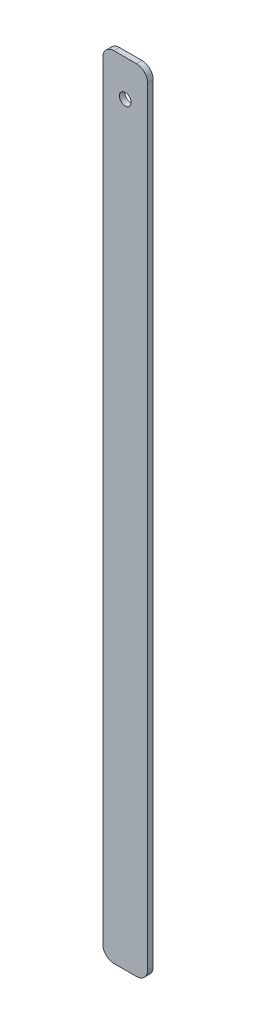
ISO-10303-21;
HEADER;
FILE_DESCRIPTION(('STEP AP214'),'2;1');
FILE_NAME('part.step','',(''),(''),'','','');
FILE_SCHEMA(('AUTOMOTIVE_DESIGN { 1 0 10303 214 1 1 1 1 }'));
ENDSEC;
DATA;
#1=APPLICATION_CONTEXT('core data for automotive mechanical design processes');
#2=APPLICATION_PROTOCOL_DEFINITION('international standard','automotive_design',2000,#1);
#3=PRODUCT_CONTEXT('',#1,'mechanical');
#4=PRODUCT('Part','Part','',(#3));
#5=PRODUCT_RELATED_PRODUCT_CATEGORY('part','',(#4));
#6=PRODUCT_DEFINITION_FORMATION('','',#4);
#7=PRODUCT_DEFINITION_CONTEXT('part definition',#1,'design');
#8=PRODUCT_DEFINITION('design','',#6,#7);
#9=PRODUCT_DEFINITION_SHAPE('','',#8);
#10=(LENGTH_UNIT() NAMED_UNIT(*) SI_UNIT(.MILLI.,.METRE.));
#11=(NAMED_UNIT(*) PLANE_ANGLE_UNIT() SI_UNIT($,.RADIAN.));
#12=(NAMED_UNIT(*) SI_UNIT($,.STERADIAN.) SOLID_ANGLE_UNIT());
#13=UNCERTAINTY_MEASURE_WITH_UNIT(LENGTH_MEASURE(1.E-05),#10,'distance_accuracy_value','');
#14=(GEOMETRIC_REPRESENTATION_CONTEXT(3) GLOBAL_UNCERTAINTY_ASSIGNED_CONTEXT((#13)) GLOBAL_UNIT_ASSIGNED_CONTEXT((#10,
#11,#12)) REPRESENTATION_CONTEXT('',''));
#15=CARTESIAN_POINT('',(0.,0.,0.));
#16=DIRECTION('',(0.,0.,1.));
#17=DIRECTION('',(1.,0.,0.));
#18=AXIS2_PLACEMENT_3D('',#15,#16,#17);
#19=CARTESIAN_POINT('',(0.,0.,1.));
#20=DIRECTION('',(0.,0.,-1.));
#21=DIRECTION('',(-1.,0.,0.));
#22=AXIS2_PLACEMENT_3D('',#19,#20,#21);
#23=PLANE('',#22);
#24=DIRECTION('',(-1.,0.,0.));
#25=VECTOR('',#24,1.);
#26=CARTESIAN_POINT('',(0.,141.2,1.));
#27=LINE('',#26,#25);
#28=CARTESIAN_POINT('',(6.,141.2,1.));
#29=VERTEX_POINT('',#28);
#30=CARTESIAN_POINT('',(2.,141.2,1.));
#31=VERTEX_POINT('',#30);
#32=EDGE_CURVE('E141',#29,#31,#27,.T.);
#33=ORIENTED_EDGE('',*,*,#32,.T.);
#34=CARTESIAN_POINT('',(2.,139.2,1.));
#35=DIRECTION('',(0.,0.,-1.));
#36=DIRECTION('',(-1.,0.,0.));
#37=AXIS2_PLACEMENT_3D('',#34,#35,#36);
#38=CIRCLE('',#37,2.);
#39=CARTESIAN_POINT('',(0.,139.2,1.));
#40=VERTEX_POINT('',#39);
#41=EDGE_CURVE('E160',#31,#40,#38,.F.);
#42=ORIENTED_EDGE('',*,*,#41,.T.);
#43=DIRECTION('',(0.,-1.,0.));
#44=VECTOR('',#43,1.);
#45=CARTESIAN_POINT('',(0.,0.,1.));
#46=LINE('',#45,#44);
#47=CARTESIAN_POINT('',(0.,2.,1.));
#48=VERTEX_POINT('',#47);
#49=EDGE_CURVE('E124',#40,#48,#46,.T.);
#50=ORIENTED_EDGE('',*,*,#49,.T.);
#51=CARTESIAN_POINT('',(2.,2.,1.));
#52=DIRECTION('',(0.,0.,-1.));
#53=DIRECTION('',(-1.,0.,0.));
#54=AXIS2_PLACEMENT_3D('',#51,#52,#53);
#55=CIRCLE('',#54,2.);
#56=CARTESIAN_POINT('',(2.,0.,1.));
#57=VERTEX_POINT('',#56);
#58=EDGE_CURVE('E155',#48,#57,#55,.F.);
#59=ORIENTED_EDGE('',*,*,#58,.T.);
#60=DIRECTION('',(1.,0.,0.));
#61=VECTOR('',#60,1.);
#62=CARTESIAN_POINT('',(0.,0.,1.));
#63=LINE('',#62,#61);
#64=CARTESIAN_POINT('',(6.,0.,1.));
#65=VERTEX_POINT('',#64);
#66=EDGE_CURVE('E171',#57,#65,#63,.T.);
#67=ORIENTED_EDGE('',*,*,#66,.T.);
#68=CARTESIAN_POINT('',(6.,2.,1.));
#69=DIRECTION('',(0.,0.,-1.));
#70=DIRECTION('',(-1.,0.,0.));
#71=AXIS2_PLACEMENT_3D('',#68,#69,#70);
#72=CIRCLE('',#71,2.);
#73=CARTESIAN_POINT('',(8.,2.,1.));
#74=VERTEX_POINT('',#73);
#75=EDGE_CURVE('E60',#65,#74,#72,.F.);
#76=ORIENTED_EDGE('',*,*,#75,.T.);
#77=DIRECTION('',(0.,1.,0.));
#78=VECTOR('',#77,1.);
#79=CARTESIAN_POINT('',(8.,0.,1.));
#80=LINE('',#79,#78);
#81=CARTESIAN_POINT('',(8.,139.2,1.));
#82=VERTEX_POINT('',#81);
#83=EDGE_CURVE('E179',#74,#82,#80,.T.);
#84=ORIENTED_EDGE('',*,*,#83,.T.);
#85=CARTESIAN_POINT('',(6.,139.2,1.));
#86=DIRECTION('',(0.,0.,-1.));
#87=DIRECTION('',(-1.,0.,0.));
#88=AXIS2_PLACEMENT_3D('',#85,#86,#87);
#89=CIRCLE('',#88,2.);
#90=EDGE_CURVE('E158',#82,#29,#89,.F.);
#91=ORIENTED_EDGE('',*,*,#90,.T.);
#92=EDGE_LOOP('',(#33,#42,#50,#59,#67,#76,#84,#91));
#93=FACE_BOUND('',#92,.T.);
#94=CARTESIAN_POINT('',(4.,134.7,1.));
#95=DIRECTION('',(0.,0.,1.));
#96=DIRECTION('',(1.,0.,0.));
#97=AXIS2_PLACEMENT_3D('',#94,#95,#96);
#98=CIRCLE('',#97,1.04999999999999);
#99=CARTESIAN_POINT('',(5.04999999999999,134.7,1.));
#100=VERTEX_POINT('',#99);
#101=EDGE_CURVE('E132',#100,#100,#98,.T.);
#102=ORIENTED_EDGE('',*,*,#101,.F.);
#103=EDGE_LOOP('',(#102));
#104=FACE_BOUND('',#103,.T.);
#105=ADVANCED_FACE('F38',(#93,#104),#23,.F.);
#106=CARTESIAN_POINT('',(0.,0.,0.));
#107=DIRECTION('',(0.,0.,-1.));
#108=DIRECTION('',(-1.,0.,0.));
#109=AXIS2_PLACEMENT_3D('',#106,#107,#108);
#110=PLANE('',#109);
#111=DIRECTION('',(0.,-1.,0.));
#112=VECTOR('',#111,1.);
#113=CARTESIAN_POINT('',(0.,0.,0.));
#114=LINE('',#113,#112);
#115=CARTESIAN_POINT('',(0.,139.2,0.));
#116=VERTEX_POINT('',#115);
#117=CARTESIAN_POINT('',(0.,2.,0.));
#118=VERTEX_POINT('',#117);
#119=EDGE_CURVE('E121',#116,#118,#114,.T.);
#120=ORIENTED_EDGE('',*,*,#119,.F.);
#121=CARTESIAN_POINT('',(2.,139.2,0.));
#122=DIRECTION('',(0.,0.,-1.));
#123=DIRECTION('',(-1.,0.,0.));
#124=AXIS2_PLACEMENT_3D('',#121,#122,#123);
#125=CIRCLE('',#124,2.);
#126=CARTESIAN_POINT('',(2.,141.2,0.));
#127=VERTEX_POINT('',#126);
#128=EDGE_CURVE('E104',#116,#127,#125,.T.);
#129=ORIENTED_EDGE('',*,*,#128,.T.);
#130=DIRECTION('',(-1.,0.,0.));
#131=VECTOR('',#130,1.);
#132=CARTESIAN_POINT('',(0.,141.2,0.));
#133=LINE('',#132,#131);
#134=CARTESIAN_POINT('',(6.,141.2,0.));
#135=VERTEX_POINT('',#134);
#136=EDGE_CURVE('E145',#135,#127,#133,.T.);
#137=ORIENTED_EDGE('',*,*,#136,.F.);
#138=CARTESIAN_POINT('',(6.,139.2,0.));
#139=DIRECTION('',(0.,0.,-1.));
#140=DIRECTION('',(-1.,0.,0.));
#141=AXIS2_PLACEMENT_3D('',#138,#139,#140);
#142=CIRCLE('',#141,2.);
#143=CARTESIAN_POINT('',(8.,139.2,0.));
#144=VERTEX_POINT('',#143);
#145=EDGE_CURVE('E115',#135,#144,#142,.T.);
#146=ORIENTED_EDGE('',*,*,#145,.T.);
#147=DIRECTION('',(0.,1.,0.));
#148=VECTOR('',#147,1.);
#149=CARTESIAN_POINT('',(8.,0.,0.));
#150=LINE('',#149,#148);
#151=CARTESIAN_POINT('',(8.,2.,0.));
#152=VERTEX_POINT('',#151);
#153=EDGE_CURVE('E135',#152,#144,#150,.T.);
#154=ORIENTED_EDGE('',*,*,#153,.F.);
#155=CARTESIAN_POINT('',(6.,2.,0.));
#156=DIRECTION('',(0.,0.,-1.));
#157=DIRECTION('',(-1.,0.,0.));
#158=AXIS2_PLACEMENT_3D('',#155,#156,#157);
#159=CIRCLE('',#158,2.);
#160=CARTESIAN_POINT('',(6.,0.,0.));
#161=VERTEX_POINT('',#160);
#162=EDGE_CURVE('E149',#152,#161,#159,.T.);
#163=ORIENTED_EDGE('',*,*,#162,.T.);
#164=DIRECTION('',(1.,0.,0.));
#165=VECTOR('',#164,1.);
#166=CARTESIAN_POINT('',(0.,0.,0.));
#167=LINE('',#166,#165);
#168=CARTESIAN_POINT('',(2.,0.,0.));
#169=VERTEX_POINT('',#168);
#170=EDGE_CURVE('E131',#169,#161,#167,.T.);
#171=ORIENTED_EDGE('',*,*,#170,.F.);
#172=CARTESIAN_POINT('',(2.,2.,0.));
#173=DIRECTION('',(0.,0.,-1.));
#174=DIRECTION('',(-1.,0.,0.));
#175=AXIS2_PLACEMENT_3D('',#172,#173,#174);
#176=CIRCLE('',#175,2.);
#177=EDGE_CURVE('E125',#169,#118,#176,.T.);
#178=ORIENTED_EDGE('',*,*,#177,.T.);
#179=EDGE_LOOP('',(#120,#129,#137,#146,#154,#163,#171,#178));
#180=FACE_BOUND('',#179,.T.);
#181=CARTESIAN_POINT('',(4.,134.7,0.));
#182=DIRECTION('',(0.,0.,1.));
#183=DIRECTION('',(1.,0.,0.));
#184=AXIS2_PLACEMENT_3D('',#181,#182,#183);
#185=CIRCLE('',#184,1.04999999999999);
#186=CARTESIAN_POINT('',(5.04999999999999,134.7,0.));
#187=VERTEX_POINT('',#186);
#188=EDGE_CURVE('E138',#187,#187,#185,.T.);
#189=ORIENTED_EDGE('',*,*,#188,.T.);
#190=EDGE_LOOP('',(#189));
#191=FACE_BOUND('',#190,.T.);
#192=ADVANCED_FACE('F128',(#180,#191),#110,.T.);
#193=CARTESIAN_POINT('',(0.,0.,1.));
#194=DIRECTION('',(1.,0.,0.));
#195=DIRECTION('',(0.,0.,-1.));
#196=AXIS2_PLACEMENT_3D('',#193,#194,#195);
#197=PLANE('',#196);
#198=ORIENTED_EDGE('',*,*,#49,.F.);
#199=DIRECTION('',(0.,0.,-1.));
#200=VECTOR('',#199,1.);
#201=CARTESIAN_POINT('',(0.,139.2,1.));
#202=LINE('',#201,#200);
#203=EDGE_CURVE('E108',#40,#116,#202,.T.);
#204=ORIENTED_EDGE('',*,*,#203,.T.);
#205=ORIENTED_EDGE('',*,*,#119,.T.);
#206=DIRECTION('',(0.,0.,-1.));
#207=VECTOR('',#206,1.);
#208=CARTESIAN_POINT('',(0.,2.,1.));
#209=LINE('',#208,#207);
#210=EDGE_CURVE('E126',#118,#48,#209,.F.);
#211=ORIENTED_EDGE('',*,*,#210,.T.);
#212=EDGE_LOOP('',(#198,#204,#205,#211));
#213=FACE_BOUND('',#212,.T.);
#214=ADVANCED_FACE('F120',(#213),#197,.F.);
#215=CARTESIAN_POINT('',(0.,0.,1.));
#216=DIRECTION('',(0.,1.,0.));
#217=DIRECTION('',(0.,0.,1.));
#218=AXIS2_PLACEMENT_3D('',#215,#216,#217);
#219=PLANE('',#218);
#220=ORIENTED_EDGE('',*,*,#170,.T.);
#221=DIRECTION('',(0.,0.,-1.));
#222=VECTOR('',#221,1.);
#223=CARTESIAN_POINT('',(6.,0.,1.));
#224=LINE('',#223,#222);
#225=EDGE_CURVE('E11',#161,#65,#224,.F.);
#226=ORIENTED_EDGE('',*,*,#225,.T.);
#227=ORIENTED_EDGE('',*,*,#66,.F.);
#228=DIRECTION('',(0.,0.,-1.));
#229=VECTOR('',#228,1.);
#230=CARTESIAN_POINT('',(2.,0.,1.));
#231=LINE('',#230,#229);
#232=EDGE_CURVE('E46',#57,#169,#231,.T.);
#233=ORIENTED_EDGE('',*,*,#232,.T.);
#234=EDGE_LOOP('',(#220,#226,#227,#233));
#235=FACE_BOUND('',#234,.T.);
#236=ADVANCED_FACE('F169',(#235),#219,.F.);
#237=CARTESIAN_POINT('',(8.,0.,1.));
#238=DIRECTION('',(-1.,0.,0.));
#239=DIRECTION('',(0.,0.,1.));
#240=AXIS2_PLACEMENT_3D('',#237,#238,#239);
#241=PLANE('',#240);
#242=ORIENTED_EDGE('',*,*,#153,.T.);
#243=DIRECTION('',(0.,0.,-1.));
#244=VECTOR('',#243,1.);
#245=CARTESIAN_POINT('',(8.,139.2,1.));
#246=LINE('',#245,#244);
#247=EDGE_CURVE('E53',#144,#82,#246,.F.);
#248=ORIENTED_EDGE('',*,*,#247,.T.);
#249=ORIENTED_EDGE('',*,*,#83,.F.);
#250=DIRECTION('',(0.,0.,-1.));
#251=VECTOR('',#250,1.);
#252=CARTESIAN_POINT('',(8.,2.,1.));
#253=LINE('',#252,#251);
#254=EDGE_CURVE('E162',#74,#152,#253,.T.);
#255=ORIENTED_EDGE('',*,*,#254,.T.);
#256=EDGE_LOOP('',(#242,#248,#249,#255));
#257=FACE_BOUND('',#256,.T.);
#258=ADVANCED_FACE('F178',(#257),#241,.F.);
#259=CARTESIAN_POINT('',(0.,141.2,1.));
#260=DIRECTION('',(0.,-1.,0.));
#261=DIRECTION('',(0.,0.,-1.));
#262=AXIS2_PLACEMENT_3D('',#259,#260,#261);
#263=PLANE('',#262);
#264=ORIENTED_EDGE('',*,*,#136,.T.);
#265=DIRECTION('',(0.,0.,-1.));
#266=VECTOR('',#265,1.);
#267=CARTESIAN_POINT('',(2.,141.2,1.));
#268=LINE('',#267,#266);
#269=EDGE_CURVE('E109',#127,#31,#268,.F.);
#270=ORIENTED_EDGE('',*,*,#269,.T.);
#271=ORIENTED_EDGE('',*,*,#32,.F.);
#272=DIRECTION('',(0.,0.,-1.));
#273=VECTOR('',#272,1.);
#274=CARTESIAN_POINT('',(6.,141.2,1.));
#275=LINE('',#274,#273);
#276=EDGE_CURVE('E114',#29,#135,#275,.T.);
#277=ORIENTED_EDGE('',*,*,#276,.T.);
#278=EDGE_LOOP('',(#264,#270,#271,#277));
#279=FACE_BOUND('',#278,.T.);
#280=ADVANCED_FACE('F190',(#279),#263,.F.);
#281=CARTESIAN_POINT('',(4.,134.7,1.));
#282=DIRECTION('',(0.,0.,-1.));
#283=DIRECTION('',(-1.,0.,0.));
#284=AXIS2_PLACEMENT_3D('',#281,#282,#283);
#285=CYLINDRICAL_SURFACE('',#284,1.04999999999999);
#286=ORIENTED_EDGE('',*,*,#101,.T.);
#287=EDGE_LOOP('',(#286));
#288=FACE_BOUND('',#287,.T.);
#289=ORIENTED_EDGE('',*,*,#188,.F.);
#290=EDGE_LOOP('',(#289));
#291=FACE_BOUND('',#290,.T.);
#292=ADVANCED_FACE('F188',(#288,#291),#285,.F.);
#293=CARTESIAN_POINT('',(2.,139.2,1.));
#294=DIRECTION('',(0.,0.,-1.));
#295=DIRECTION('',(-1.,0.,0.));
#296=AXIS2_PLACEMENT_3D('',#293,#294,#295);
#297=CYLINDRICAL_SURFACE('',#296,2.);
#298=ORIENTED_EDGE('',*,*,#41,.F.);
#299=ORIENTED_EDGE('',*,*,#269,.F.);
#300=ORIENTED_EDGE('',*,*,#128,.F.);
#301=ORIENTED_EDGE('',*,*,#203,.F.);
#302=EDGE_LOOP('',(#298,#299,#300,#301));
#303=FACE_BOUND('',#302,.T.);
#304=ADVANCED_FACE('F107',(#303),#297,.T.);
#305=CARTESIAN_POINT('',(6.,139.2,1.));
#306=DIRECTION('',(0.,0.,-1.));
#307=DIRECTION('',(-1.,0.,0.));
#308=AXIS2_PLACEMENT_3D('',#305,#306,#307);
#309=CYLINDRICAL_SURFACE('',#308,2.);
#310=ORIENTED_EDGE('',*,*,#90,.F.);
#311=ORIENTED_EDGE('',*,*,#247,.F.);
#312=ORIENTED_EDGE('',*,*,#145,.F.);
#313=ORIENTED_EDGE('',*,*,#276,.F.);
#314=EDGE_LOOP('',(#310,#311,#312,#313));
#315=FACE_BOUND('',#314,.T.);
#316=ADVANCED_FACE('F197',(#315),#309,.T.);
#317=CARTESIAN_POINT('',(6.,2.,1.));
#318=DIRECTION('',(0.,0.,-1.));
#319=DIRECTION('',(-1.,0.,0.));
#320=AXIS2_PLACEMENT_3D('',#317,#318,#319);
#321=CYLINDRICAL_SURFACE('',#320,2.);
#322=ORIENTED_EDGE('',*,*,#75,.F.);
#323=ORIENTED_EDGE('',*,*,#225,.F.);
#324=ORIENTED_EDGE('',*,*,#162,.F.);
#325=ORIENTED_EDGE('',*,*,#254,.F.);
#326=EDGE_LOOP('',(#322,#323,#324,#325));
#327=FACE_BOUND('',#326,.T.);
#328=ADVANCED_FACE('F177',(#327),#321,.T.);
#329=CARTESIAN_POINT('',(2.,2.,1.));
#330=DIRECTION('',(0.,0.,-1.));
#331=DIRECTION('',(-1.,0.,0.));
#332=AXIS2_PLACEMENT_3D('',#329,#330,#331);
#333=CYLINDRICAL_SURFACE('',#332,2.);
#334=ORIENTED_EDGE('',*,*,#58,.F.);
#335=ORIENTED_EDGE('',*,*,#210,.F.);
#336=ORIENTED_EDGE('',*,*,#177,.F.);
#337=ORIENTED_EDGE('',*,*,#232,.F.);
#338=EDGE_LOOP('',(#334,#335,#336,#337));
#339=FACE_BOUND('',#338,.T.);
#340=ADVANCED_FACE('F40',(#339),#333,.T.);
#341=CLOSED_SHELL('',(#105,#192,#214,#236,#258,#280,#292,#304,#316,#328,#340));
#342=MANIFOLD_SOLID_BREP('B2',#341);
#343=ADVANCED_BREP_SHAPE_REPRESENTATION('',(#18,#342),#14);
#344=SHAPE_DEFINITION_REPRESENTATION(#9,#343);
ENDSEC;
END-ISO-10303-21;
